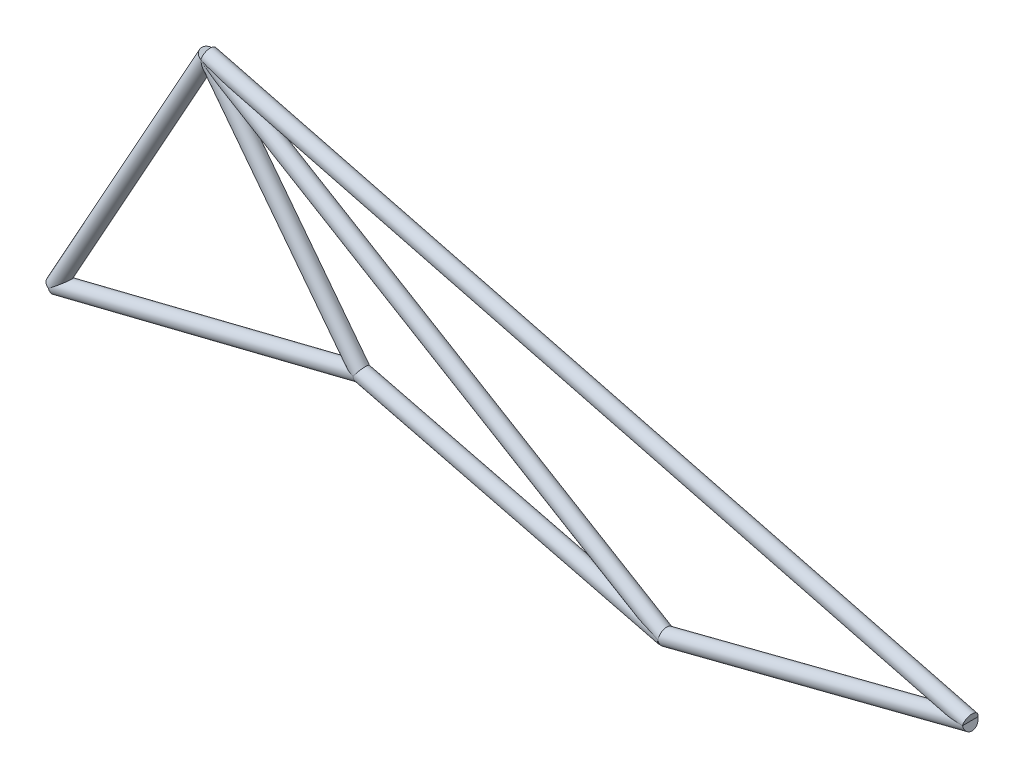
ISO-10303-21;
HEADER;
FILE_DESCRIPTION(('STEP AP214'),'2;1');
FILE_NAME('part.step','',(''),(''),'','','');
FILE_SCHEMA(('AUTOMOTIVE_DESIGN { 1 0 10303 214 1 1 1 1 }'));
ENDSEC;
DATA;
#1=APPLICATION_CONTEXT('core data for automotive mechanical design processes');
#2=APPLICATION_PROTOCOL_DEFINITION('international standard','automotive_design',2000,#1);
#3=PRODUCT_CONTEXT('',#1,'mechanical');
#4=PRODUCT('Part','Part','',(#3));
#5=PRODUCT_RELATED_PRODUCT_CATEGORY('part','',(#4));
#6=PRODUCT_DEFINITION_FORMATION('','',#4);
#7=PRODUCT_DEFINITION_CONTEXT('part definition',#1,'design');
#8=PRODUCT_DEFINITION('design','',#6,#7);
#9=PRODUCT_DEFINITION_SHAPE('','',#8);
#10=(LENGTH_UNIT() NAMED_UNIT(*) SI_UNIT(.MILLI.,.METRE.));
#11=(NAMED_UNIT(*) PLANE_ANGLE_UNIT() SI_UNIT($,.RADIAN.));
#12=(NAMED_UNIT(*) SI_UNIT($,.STERADIAN.) SOLID_ANGLE_UNIT());
#13=UNCERTAINTY_MEASURE_WITH_UNIT(LENGTH_MEASURE(1.E-05),#10,'distance_accuracy_value','');
#14=(GEOMETRIC_REPRESENTATION_CONTEXT(3) GLOBAL_UNCERTAINTY_ASSIGNED_CONTEXT((#13)) GLOBAL_UNIT_ASSIGNED_CONTEXT((#10,
#11,#12)) REPRESENTATION_CONTEXT('',''));
#15=CARTESIAN_POINT('',(0.,0.,0.));
#16=DIRECTION('',(0.,0.,1.));
#17=DIRECTION('',(1.,0.,0.));
#18=AXIS2_PLACEMENT_3D('',#15,#16,#17);
#19=CARTESIAN_POINT('',(2540.,635.,0.));
#20=DIRECTION('',(-0.609710760849692,0.7926239891046,0.));
#21=DIRECTION('',(-0.7926239891046,-0.609710760849692,0.));
#22=AXIS2_PLACEMENT_3D('',#19,#20,#21);
#23=CYLINDRICAL_SURFACE('',#22,63.5);
#24=CARTESIAN_POINT('',(1270.,2286.,0.));
#25=DIRECTION('',(0.550860844321992,0.834597106508801,0.));
#26=DIRECTION('',(-0.834597106508801,0.550860844321992,0.));
#27=AXIS2_PLACEMENT_3D('',#24,#25,#26);
#28=ELLIPSE('',#27,194.991091358338,63.5);
#29=CARTESIAN_POINT('',(1270.,2286.,63.5));
#30=VERTEX_POINT('',#29);
#31=CARTESIAN_POINT('',(1270.,2286.,-63.5));
#32=VERTEX_POINT('',#31);
#33=EDGE_CURVE('E90',#30,#32,#28,.T.);
#34=ORIENTED_EDGE('',*,*,#33,.F.);
#35=CARTESIAN_POINT('',(1270.,2286.,0.));
#36=DIRECTION('',(-0.997241131415683,-0.0742302216941886,0.));
#37=DIRECTION('',(-0.0742302216941887,0.997241131415683,0.));
#38=AXIS2_PLACEMENT_3D('',#35,#36,#37);
#39=ELLIPSE('',#38,115.624409367962,63.5);
#40=EDGE_CURVE('E82',#32,#30,#39,.T.);
#41=ORIENTED_EDGE('',*,*,#40,.F.);
#42=EDGE_LOOP('',(#34,#41));
#43=FACE_BOUND('',#42,.T.);
#44=CARTESIAN_POINT('',(2540.,635.,0.));
#45=DIRECTION('',(-0.836440902658388,0.548057128737526,0.));
#46=DIRECTION('',(0.548057128737526,0.836440902658388,0.));
#47=AXIS2_PLACEMENT_3D('',#44,#45,#46);
#48=ELLIPSE('',#47,67.2391526860607,63.5);
#49=CARTESIAN_POINT('',(2540.,634.999999999998,-63.5));
#50=VERTEX_POINT('',#49);
#51=CARTESIAN_POINT('',(2540.,635.,63.5));
#52=VERTEX_POINT('',#51);
#53=EDGE_CURVE('E86',#50,#52,#48,.F.);
#54=ORIENTED_EDGE('',*,*,#53,.F.);
#55=CARTESIAN_POINT('',(2540.,635.,0.));
#56=DIRECTION('',(0.328826795963689,0.9443902468028,0.));
#57=DIRECTION('',(-0.9443902468028,0.328826795963689,0.));
#58=AXIS2_PLACEMENT_3D('',#55,#56,#57);
#59=ELLIPSE('',#58,115.863833659595,63.5);
#60=EDGE_CURVE('E13',#52,#50,#59,.F.);
#61=ORIENTED_EDGE('',*,*,#60,.F.);
#62=EDGE_LOOP('',(#54,#61));
#63=FACE_BOUND('',#62,.T.);
#64=ADVANCED_FACE('F56',(#43,#63),#23,.T.);
#65=CARTESIAN_POINT('',(7620.,653.142857142857,0.));
#66=DIRECTION('',(-0.96849293259685,0.249041039810619,0.));
#67=DIRECTION('',(-0.249041039810619,-0.96849293259685,0.));
#68=AXIS2_PLACEMENT_3D('',#65,#66,#67);
#69=CYLINDRICAL_SURFACE('',#68,63.5);
#70=ORIENTED_EDGE('',*,*,#33,.T.);
#71=CARTESIAN_POINT('',(1270.,2286.,0.));
#72=DIRECTION('',(-0.918706368655255,-0.394941271826933,0.));
#73=DIRECTION('',(-0.394941271826933,0.918706368655255,0.));
#74=AXIS2_PLACEMENT_3D('',#71,#72,#73);
#75=ELLIPSE('',#74,80.2371440838296,63.5);
#76=EDGE_CURVE('E79',#32,#30,#75,.T.);
#77=ORIENTED_EDGE('',*,*,#76,.T.);
#78=EDGE_LOOP('',(#70,#77));
#79=FACE_BOUND('',#78,.T.);
#80=ADVANCED_FACE('F89',(#79),#69,.F.);
#81=CARTESIAN_POINT('',(1270.,2286.,0.));
#82=DIRECTION('',(-0.485642931178632,-0.874157276121538,0.));
#83=DIRECTION('',(0.874157276121538,-0.485642931178632,0.));
#84=AXIS2_PLACEMENT_3D('',#81,#82,#83);
#85=CYLINDRICAL_SURFACE('',#84,63.5);
#86=ORIENTED_EDGE('',*,*,#40,.T.);
#87=ORIENTED_EDGE('',*,*,#76,.F.);
#88=EDGE_LOOP('',(#86,#87));
#89=FACE_BOUND('',#88,.T.);
#90=ADVANCED_FACE('F83',(#89),#85,.F.);
#91=CARTESIAN_POINT('',(2540.,635.,0.));
#92=DIRECTION('',(0.970142500145332,-0.242535625036333,0.));
#93=DIRECTION('',(0.242535625036333,0.970142500145332,0.));
#94=AXIS2_PLACEMENT_3D('',#91,#92,#93);
#95=CYLINDRICAL_SURFACE('',#94,63.5);
#96=ORIENTED_EDGE('',*,*,#53,.T.);
#97=CARTESIAN_POINT('',(2540.,635.,0.));
#98=DIRECTION('',(-1.,0.,0.));
#99=DIRECTION('',(0.,-1.,0.));
#100=AXIS2_PLACEMENT_3D('',#97,#98,#99);
#101=ELLIPSE('',#100,65.4543018066804,63.5);
#102=EDGE_CURVE('E60',#52,#50,#101,.T.);
#103=ORIENTED_EDGE('',*,*,#102,.T.);
#104=EDGE_LOOP('',(#96,#103));
#105=FACE_BOUND('',#104,.T.);
#106=ADVANCED_FACE('F58',(#105),#95,.F.);
#107=CARTESIAN_POINT('',(4.44089209850063E-13,1.11022302462516E-13,0.));
#108=DIRECTION('',(0.970142500145332,0.242535625036333,0.));
#109=DIRECTION('',(-0.242535625036333,0.970142500145332,0.));
#110=AXIS2_PLACEMENT_3D('',#107,#108,#109);
#111=CYLINDRICAL_SURFACE('',#110,63.5);
#112=ORIENTED_EDGE('',*,*,#60,.T.);
#113=ORIENTED_EDGE('',*,*,#102,.F.);
#114=EDGE_LOOP('',(#112,#113));
#115=FACE_BOUND('',#114,.T.);
#116=ADVANCED_FACE('F97',(#115),#111,.F.);
#117=CLOSED_SHELL('',(#64,#80,#90,#106,#116));
#118=MANIFOLD_SOLID_BREP('B2',#117);
#119=CARTESIAN_POINT('',(5080.,8.88178419700125E-13,0.));
#120=DIRECTION('',(0.96849293259685,0.249041039810618,0.));
#121=DIRECTION('',(-0.249041039810618,0.96849293259685,0.));
#122=AXIS2_PLACEMENT_3D('',#119,#120,#121);
#123=CYLINDRICAL_SURFACE('',#122,63.5);
#124=CARTESIAN_POINT('',(5080.,6.10027597604144E-13,0.));
#125=DIRECTION('',(0.989597492977376,-0.143863831079574,0.));
#126=DIRECTION('',(-0.143863831079575,-0.989597492977376,0.));
#127=AXIS2_PLACEMENT_3D('',#124,#125,#126);
#128=ELLIPSE('',#127,68.8279599955324,63.5);
#129=CARTESIAN_POINT('',(5080.,6.10027597604144E-13,-63.5));
#130=VERTEX_POINT('',#129);
#131=CARTESIAN_POINT('',(5080.,1.02157613714085E-13,63.5));
#132=VERTEX_POINT('',#131);
#133=EDGE_CURVE('E207',#130,#132,#128,.T.);
#134=ORIENTED_EDGE('',*,*,#133,.T.);
#135=CARTESIAN_POINT('',(5080.,1.11022302462516E-13,0.));
#136=DIRECTION('',(0.99999436979734,0.00335564801798752,0.));
#137=DIRECTION('',(0.00335564801798752,-0.99999436979734,0.));
#138=AXIS2_PLACEMENT_3D('',#135,#136,#137);
#139=ELLIPSE('',#138,65.5096274520388,63.5);
#140=EDGE_CURVE('E198',#130,#132,#139,.T.);
#141=ORIENTED_EDGE('',*,*,#140,.F.);
#142=EDGE_LOOP('',(#134,#141));
#143=FACE_BOUND('',#142,.T.);
#144=ADVANCED_FACE('F178',(#143),#123,.F.);
#145=CARTESIAN_POINT('',(2540.,635.,0.));
#146=DIRECTION('',(0.970142500145332,-0.242535625036333,0.));
#147=DIRECTION('',(0.242535625036333,0.970142500145332,0.));
#148=AXIS2_PLACEMENT_3D('',#145,#146,#147);
#149=CYLINDRICAL_SURFACE('',#148,63.5);
#150=CARTESIAN_POINT('',(5079.99999999999,2.60902410786912E-12,0.));
#151=DIRECTION('',(-0.38268343236509,-0.923879532511287,0.));
#152=DIRECTION('',(0.923879532511287,-0.38268343236509,0.));
#153=AXIS2_PLACEMENT_3D('',#150,#151,#152);
#154=ELLIPSE('',#153,431.433462177561,63.5);
#155=EDGE_CURVE('E210',#132,#130,#154,.T.);
#156=ORIENTED_EDGE('',*,*,#155,.T.);
#157=ORIENTED_EDGE('',*,*,#140,.T.);
#158=EDGE_LOOP('',(#156,#157));
#159=FACE_BOUND('',#158,.T.);
#160=ADVANCED_FACE('F180',(#159),#149,.F.);
#161=CARTESIAN_POINT('',(1270.,2286.,0.));
#162=DIRECTION('',(0.857492925712544,-0.514495755427526,0.));
#163=DIRECTION('',(0.514495755427526,0.857492925712544,0.));
#164=AXIS2_PLACEMENT_3D('',#161,#162,#163);
#165=CYLINDRICAL_SURFACE('',#164,63.5);
#166=ORIENTED_EDGE('',*,*,#155,.F.);
#167=ORIENTED_EDGE('',*,*,#133,.F.);
#168=EDGE_LOOP('',(#166,#167));
#169=FACE_BOUND('',#168,.T.);
#170=CARTESIAN_POINT('',(1269.99999999999,2286.,0.));
#171=DIRECTION('',(-0.385781492301942,-0.922590179980953,0.));
#172=DIRECTION('',(0.922590179980953,-0.385781492301942,0.));
#173=AXIS2_PLACEMENT_3D('',#170,#171,#172);
#174=ELLIPSE('',#173,441.389607961133,63.5);
#175=CARTESIAN_POINT('',(1270.,2286.,63.5));
#176=VERTEX_POINT('',#175);
#177=CARTESIAN_POINT('',(1270.,2286.,-63.5));
#178=VERTEX_POINT('',#177);
#179=EDGE_CURVE('E54',#176,#178,#174,.F.);
#180=ORIENTED_EDGE('',*,*,#179,.F.);
#181=CARTESIAN_POINT('',(1270.,2286.,0.));
#182=DIRECTION('',(0.965967283620051,0.258664274641281,0.));
#183=DIRECTION('',(0.258664274641281,-0.965967283620051,0.));
#184=AXIS2_PLACEMENT_3D('',#181,#182,#183);
#185=ELLIPSE('',#184,91.3368847911609,63.5);
#186=EDGE_CURVE('E186',#178,#176,#185,.F.);
#187=ORIENTED_EDGE('',*,*,#186,.F.);
#188=EDGE_LOOP('',(#180,#187));
#189=FACE_BOUND('',#188,.T.);
#190=ADVANCED_FACE('F212',(#169,#189),#165,.T.);
#191=CARTESIAN_POINT('',(1270.,2286.,0.));
#192=DIRECTION('',(-0.485642931178632,-0.874157276121538,0.));
#193=DIRECTION('',(0.874157276121538,-0.485642931178632,0.));
#194=AXIS2_PLACEMENT_3D('',#191,#192,#193);
#195=CYLINDRICAL_SURFACE('',#194,63.5);
#196=ORIENTED_EDGE('',*,*,#186,.T.);
#197=CARTESIAN_POINT('',(1270.,2286.,0.));
#198=DIRECTION('',(-0.918706368655255,-0.394941271826933,0.));
#199=DIRECTION('',(-0.394941271826933,0.918706368655255,0.));
#200=AXIS2_PLACEMENT_3D('',#197,#198,#199);
#201=ELLIPSE('',#200,80.2371440838296,63.5);
#202=EDGE_CURVE('E192',#178,#176,#201,.T.);
#203=ORIENTED_EDGE('',*,*,#202,.F.);
#204=EDGE_LOOP('',(#196,#203));
#205=FACE_BOUND('',#204,.T.);
#206=ADVANCED_FACE('F204',(#205),#195,.F.);
#207=CARTESIAN_POINT('',(7620.,653.142857142857,0.));
#208=DIRECTION('',(-0.96849293259685,0.249041039810619,0.));
#209=DIRECTION('',(-0.249041039810619,-0.96849293259685,0.));
#210=AXIS2_PLACEMENT_3D('',#207,#208,#209);
#211=CYLINDRICAL_SURFACE('',#210,63.5);
#212=ORIENTED_EDGE('',*,*,#179,.T.);
#213=ORIENTED_EDGE('',*,*,#202,.T.);
#214=EDGE_LOOP('',(#212,#213));
#215=FACE_BOUND('',#214,.T.);
#216=ADVANCED_FACE('F209',(#215),#211,.F.);
#217=CLOSED_SHELL('',(#144,#160,#190,#206,#216));
#218=MANIFOLD_SOLID_BREP('B7',#217);
#219=CARTESIAN_POINT('',(2540.,635.,0.));
#220=DIRECTION('',(0.970142500145332,-0.242535625036333,0.));
#221=DIRECTION('',(0.242535625036333,0.970142500145332,0.));
#222=AXIS2_PLACEMENT_3D('',#219,#220,#221);
#223=CYLINDRICAL_SURFACE('',#222,63.5);
#224=CARTESIAN_POINT('',(2540.,635.,0.));
#225=DIRECTION('',(-0.970142500145332,0.242535625036333,0.));
#226=DIRECTION('',(-0.242535625036333,-0.970142500145332,0.));
#227=AXIS2_PLACEMENT_3D('',#224,#225,#226);
#228=CIRCLE('',#227,63.5);
#229=CARTESIAN_POINT('',(2524.59898781019,573.395951240771,0.));
#230=VERTEX_POINT('',#229);
#231=EDGE_CURVE('E177',#230,#230,#228,.T.);
#232=ORIENTED_EDGE('',*,*,#231,.F.);
#233=EDGE_LOOP('',(#232));
#234=FACE_BOUND('',#233,.T.);
#235=CARTESIAN_POINT('',(5080.,-3.33066907387547E-13,0.));
#236=DIRECTION('',(-0.970142500145332,0.242535625036333,0.));
#237=DIRECTION('',(-0.242535625036333,-0.970142500145332,0.));
#238=AXIS2_PLACEMENT_3D('',#235,#236,#237);
#239=CIRCLE('',#238,63.5);
#240=CARTESIAN_POINT('',(5064.59898781019,-61.604048759229,0.));
#241=VERTEX_POINT('',#240);
#242=EDGE_CURVE('E305',#241,#241,#239,.T.);
#243=ORIENTED_EDGE('',*,*,#242,.T.);
#244=EDGE_LOOP('',(#243));
#245=FACE_BOUND('',#244,.T.);
#246=ADVANCED_FACE('F302',(#234,#245),#223,.T.);
#247=CARTESIAN_POINT('',(2540.,635.,0.));
#248=DIRECTION('',(-0.970142500145332,0.242535625036333,0.));
#249=DIRECTION('',(-0.242535625036333,-0.970142500145332,0.));
#250=AXIS2_PLACEMENT_3D('',#247,#248,#249);
#251=PLANE('',#250);
#252=ORIENTED_EDGE('',*,*,#231,.T.);
#253=EDGE_LOOP('',(#252));
#254=FACE_BOUND('',#253,.T.);
#255=ADVANCED_FACE('F317',(#254),#251,.T.);
#256=CARTESIAN_POINT('',(5080.,-3.33066907387547E-13,0.));
#257=DIRECTION('',(-0.970142500145332,0.242535625036333,0.));
#258=DIRECTION('',(-0.242535625036333,-0.970142500145332,0.));
#259=AXIS2_PLACEMENT_3D('',#256,#257,#258);
#260=PLANE('',#259);
#261=ORIENTED_EDGE('',*,*,#242,.F.);
#262=EDGE_LOOP('',(#261));
#263=FACE_BOUND('',#262,.T.);
#264=ADVANCED_FACE('F315',(#263),#260,.F.);
#265=CLOSED_SHELL('',(#246,#255,#264));
#266=MANIFOLD_SOLID_BREP('B48',#265);
#267=CARTESIAN_POINT('',(5080.,8.88178419700125E-13,0.));
#268=DIRECTION('',(0.96849293259685,0.249041039810618,0.));
#269=DIRECTION('',(-0.249041039810618,0.96849293259685,0.));
#270=AXIS2_PLACEMENT_3D('',#267,#268,#269);
#271=CYLINDRICAL_SURFACE('',#270,63.5);
#272=CARTESIAN_POINT('',(5080.,8.88178419700125E-13,0.));
#273=DIRECTION('',(-0.96849293259685,-0.249041039810618,0.));
#274=DIRECTION('',(0.249041039810618,-0.96849293259685,0.));
#275=AXIS2_PLACEMENT_3D('',#272,#273,#274);
#276=CIRCLE('',#275,63.5);
#277=CARTESIAN_POINT('',(5095.81410602798,-61.4993012198991,0.));
#278=VERTEX_POINT('',#277);
#279=EDGE_CURVE('E301',#278,#278,#276,.T.);
#280=ORIENTED_EDGE('',*,*,#279,.F.);
#281=EDGE_LOOP('',(#280));
#282=FACE_BOUND('',#281,.T.);
#283=CARTESIAN_POINT('',(7620.,653.142857142858,0.));
#284=DIRECTION('',(-0.96849293259685,-0.249041039810618,0.));
#285=DIRECTION('',(0.249041039810618,-0.96849293259685,0.));
#286=AXIS2_PLACEMENT_3D('',#283,#284,#285);
#287=CIRCLE('',#286,63.5);
#288=CARTESIAN_POINT('',(7635.81410602798,591.643555922958,0.));
#289=VERTEX_POINT('',#288);
#290=EDGE_CURVE('E359',#289,#289,#287,.T.);
#291=ORIENTED_EDGE('',*,*,#290,.T.);
#292=EDGE_LOOP('',(#291));
#293=FACE_BOUND('',#292,.T.);
#294=ADVANCED_FACE('F356',(#282,#293),#271,.T.);
#295=CARTESIAN_POINT('',(5080.,8.88178419700125E-13,0.));
#296=DIRECTION('',(-0.96849293259685,-0.249041039810618,0.));
#297=DIRECTION('',(0.249041039810618,-0.96849293259685,0.));
#298=AXIS2_PLACEMENT_3D('',#295,#296,#297);
#299=PLANE('',#298);
#300=ORIENTED_EDGE('',*,*,#279,.T.);
#301=EDGE_LOOP('',(#300));
#302=FACE_BOUND('',#301,.T.);
#303=ADVANCED_FACE('F371',(#302),#299,.T.);
#304=CARTESIAN_POINT('',(7620.,653.142857142858,0.));
#305=DIRECTION('',(-0.96849293259685,-0.249041039810618,0.));
#306=DIRECTION('',(0.249041039810618,-0.96849293259685,0.));
#307=AXIS2_PLACEMENT_3D('',#304,#305,#306);
#308=PLANE('',#307);
#309=ORIENTED_EDGE('',*,*,#290,.F.);
#310=EDGE_LOOP('',(#309));
#311=FACE_BOUND('',#310,.T.);
#312=ADVANCED_FACE('F369',(#311),#308,.F.);
#313=CLOSED_SHELL('',(#294,#303,#312));
#314=MANIFOLD_SOLID_BREP('B172',#313);
#315=CARTESIAN_POINT('',(7620.,653.142857142857,0.));
#316=DIRECTION('',(-0.96849293259685,0.249041039810619,0.));
#317=DIRECTION('',(-0.249041039810619,-0.96849293259685,0.));
#318=AXIS2_PLACEMENT_3D('',#315,#316,#317);
#319=CYLINDRICAL_SURFACE('',#318,63.5);
#320=CARTESIAN_POINT('',(7620.,653.142857142857,0.));
#321=DIRECTION('',(0.96849293259685,-0.249041039810618,0.));
#322=DIRECTION('',(0.249041039810618,0.96849293259685,0.));
#323=AXIS2_PLACEMENT_3D('',#320,#321,#322);
#324=CIRCLE('',#323,63.5);
#325=CARTESIAN_POINT('',(7635.81410602797,714.642158362757,0.));
#326=VERTEX_POINT('',#325);
#327=EDGE_CURVE('E355',#326,#326,#324,.T.);
#328=ORIENTED_EDGE('',*,*,#327,.F.);
#329=EDGE_LOOP('',(#328));
#330=FACE_BOUND('',#329,.T.);
#331=CARTESIAN_POINT('',(1270.,2286.,0.));
#332=DIRECTION('',(0.96849293259685,-0.249041039810618,0.));
#333=DIRECTION('',(0.249041039810618,0.96849293259685,0.));
#334=AXIS2_PLACEMENT_3D('',#331,#332,#333);
#335=CIRCLE('',#334,63.5);
#336=CARTESIAN_POINT('',(1285.81410602797,2347.4993012199,0.));
#337=VERTEX_POINT('',#336);
#338=EDGE_CURVE('E413',#337,#337,#335,.T.);
#339=ORIENTED_EDGE('',*,*,#338,.T.);
#340=EDGE_LOOP('',(#339));
#341=FACE_BOUND('',#340,.T.);
#342=ADVANCED_FACE('F410',(#330,#341),#319,.T.);
#343=CARTESIAN_POINT('',(7620.,653.142857142857,0.));
#344=DIRECTION('',(0.96849293259685,-0.249041039810618,0.));
#345=DIRECTION('',(0.249041039810618,0.96849293259685,0.));
#346=AXIS2_PLACEMENT_3D('',#343,#344,#345);
#347=PLANE('',#346);
#348=ORIENTED_EDGE('',*,*,#327,.T.);
#349=EDGE_LOOP('',(#348));
#350=FACE_BOUND('',#349,.T.);
#351=ADVANCED_FACE('F425',(#350),#347,.T.);
#352=CARTESIAN_POINT('',(1270.,2286.,0.));
#353=DIRECTION('',(0.96849293259685,-0.249041039810618,0.));
#354=DIRECTION('',(0.249041039810618,0.96849293259685,0.));
#355=AXIS2_PLACEMENT_3D('',#352,#353,#354);
#356=PLANE('',#355);
#357=ORIENTED_EDGE('',*,*,#338,.F.);
#358=EDGE_LOOP('',(#357));
#359=FACE_BOUND('',#358,.T.);
#360=ADVANCED_FACE('F423',(#359),#356,.F.);
#361=CLOSED_SHELL('',(#342,#351,#360));
#362=MANIFOLD_SOLID_BREP('B296',#361);
#363=CARTESIAN_POINT('',(1270.,2286.,0.));
#364=DIRECTION('',(-0.485642931178632,-0.874157276121538,0.));
#365=DIRECTION('',(0.874157276121538,-0.485642931178632,0.));
#366=AXIS2_PLACEMENT_3D('',#363,#364,#365);
#367=CYLINDRICAL_SURFACE('',#366,63.5);
#368=CARTESIAN_POINT('',(1270.,2286.,0.));
#369=DIRECTION('',(0.485642931178632,0.874157276121538,0.));
#370=DIRECTION('',(-0.874157276121538,0.485642931178632,0.));
#371=AXIS2_PLACEMENT_3D('',#368,#369,#370);
#372=CIRCLE('',#371,63.5);
#373=CARTESIAN_POINT('',(1214.49101296628,2316.83832612984,0.));
#374=VERTEX_POINT('',#373);
#375=EDGE_CURVE('E409',#374,#374,#372,.T.);
#376=ORIENTED_EDGE('',*,*,#375,.F.);
#377=EDGE_LOOP('',(#376));
#378=FACE_BOUND('',#377,.T.);
#379=CARTESIAN_POINT('',(-4.44089209850063E-13,-4.44089209850063E-13,0.));
#380=DIRECTION('',(0.485642931178632,0.874157276121538,0.));
#381=DIRECTION('',(-0.874157276121538,0.485642931178632,0.));
#382=AXIS2_PLACEMENT_3D('',#379,#380,#381);
#383=CIRCLE('',#382,63.5);
#384=CARTESIAN_POINT('',(-55.5089870337181,30.8383261298427,0.));
#385=VERTEX_POINT('',#384);
#386=EDGE_CURVE('E466',#385,#385,#383,.T.);
#387=ORIENTED_EDGE('',*,*,#386,.T.);
#388=EDGE_LOOP('',(#387));
#389=FACE_BOUND('',#388,.T.);
#390=ADVANCED_FACE('F463',(#378,#389),#367,.T.);
#391=CARTESIAN_POINT('',(1270.,2286.,0.));
#392=DIRECTION('',(0.485642931178632,0.874157276121538,0.));
#393=DIRECTION('',(-0.874157276121538,0.485642931178632,0.));
#394=AXIS2_PLACEMENT_3D('',#391,#392,#393);
#395=PLANE('',#394);
#396=ORIENTED_EDGE('',*,*,#375,.T.);
#397=EDGE_LOOP('',(#396));
#398=FACE_BOUND('',#397,.T.);
#399=ADVANCED_FACE('F478',(#398),#395,.T.);
#400=CARTESIAN_POINT('',(-4.44089209850063E-13,-4.44089209850063E-13,0.));
#401=DIRECTION('',(0.485642931178632,0.874157276121538,0.));
#402=DIRECTION('',(-0.874157276121538,0.485642931178632,0.));
#403=AXIS2_PLACEMENT_3D('',#400,#401,#402);
#404=PLANE('',#403);
#405=ORIENTED_EDGE('',*,*,#386,.F.);
#406=EDGE_LOOP('',(#405));
#407=FACE_BOUND('',#406,.T.);
#408=ADVANCED_FACE('F476',(#407),#404,.F.);
#409=CLOSED_SHELL('',(#390,#399,#408));
#410=MANIFOLD_SOLID_BREP('B350',#409);
#411=CARTESIAN_POINT('',(4.44089209850063E-13,1.11022302462516E-13,0.));
#412=DIRECTION('',(0.970142500145332,0.242535625036333,0.));
#413=DIRECTION('',(-0.242535625036333,0.970142500145332,0.));
#414=AXIS2_PLACEMENT_3D('',#411,#412,#413);
#415=CYLINDRICAL_SURFACE('',#414,63.5);
#416=CARTESIAN_POINT('',(4.44089209850063E-13,1.11022302462516E-13,0.));
#417=DIRECTION('',(-0.970142500145332,-0.242535625036333,0.));
#418=DIRECTION('',(0.242535625036333,-0.970142500145332,0.));
#419=AXIS2_PLACEMENT_3D('',#416,#417,#418);
#420=CIRCLE('',#419,63.5);
#421=CARTESIAN_POINT('',(15.4010121898076,-61.6040487592285,0.));
#422=VERTEX_POINT('',#421);
#423=EDGE_CURVE('E462',#422,#422,#420,.T.);
#424=ORIENTED_EDGE('',*,*,#423,.F.);
#425=EDGE_LOOP('',(#424));
#426=FACE_BOUND('',#425,.T.);
#427=CARTESIAN_POINT('',(2540.,635.,0.));
#428=DIRECTION('',(-0.970142500145332,-0.242535625036333,0.));
#429=DIRECTION('',(0.242535625036333,-0.970142500145332,0.));
#430=AXIS2_PLACEMENT_3D('',#427,#428,#429);
#431=CIRCLE('',#430,63.5);
#432=CARTESIAN_POINT('',(2555.40101218981,573.395951240772,0.));
#433=VERTEX_POINT('',#432);
#434=EDGE_CURVE('E512',#433,#433,#431,.T.);
#435=ORIENTED_EDGE('',*,*,#434,.T.);
#436=EDGE_LOOP('',(#435));
#437=FACE_BOUND('',#436,.T.);
#438=ADVANCED_FACE('F509',(#426,#437),#415,.T.);
#439=CARTESIAN_POINT('',(4.44089209850063E-13,1.11022302462516E-13,0.));
#440=DIRECTION('',(-0.970142500145332,-0.242535625036333,0.));
#441=DIRECTION('',(0.242535625036333,-0.970142500145332,0.));
#442=AXIS2_PLACEMENT_3D('',#439,#440,#441);
#443=PLANE('',#442);
#444=ORIENTED_EDGE('',*,*,#423,.T.);
#445=EDGE_LOOP('',(#444));
#446=FACE_BOUND('',#445,.T.);
#447=ADVANCED_FACE('F524',(#446),#443,.T.);
#448=CARTESIAN_POINT('',(2540.,635.,0.));
#449=DIRECTION('',(-0.970142500145332,-0.242535625036333,0.));
#450=DIRECTION('',(0.242535625036333,-0.970142500145332,0.));
#451=AXIS2_PLACEMENT_3D('',#448,#449,#450);
#452=PLANE('',#451);
#453=ORIENTED_EDGE('',*,*,#434,.F.);
#454=EDGE_LOOP('',(#453));
#455=FACE_BOUND('',#454,.T.);
#456=ADVANCED_FACE('F522',(#455),#452,.F.);
#457=CLOSED_SHELL('',(#438,#447,#456));
#458=MANIFOLD_SOLID_BREP('B404',#457);
#459=ADVANCED_BREP_SHAPE_REPRESENTATION('',(#18,#118,#218,#266,#314,#362,#410,#458),#14);
#460=SHAPE_DEFINITION_REPRESENTATION(#9,#459);
ENDSEC;
END-ISO-10303-21;
